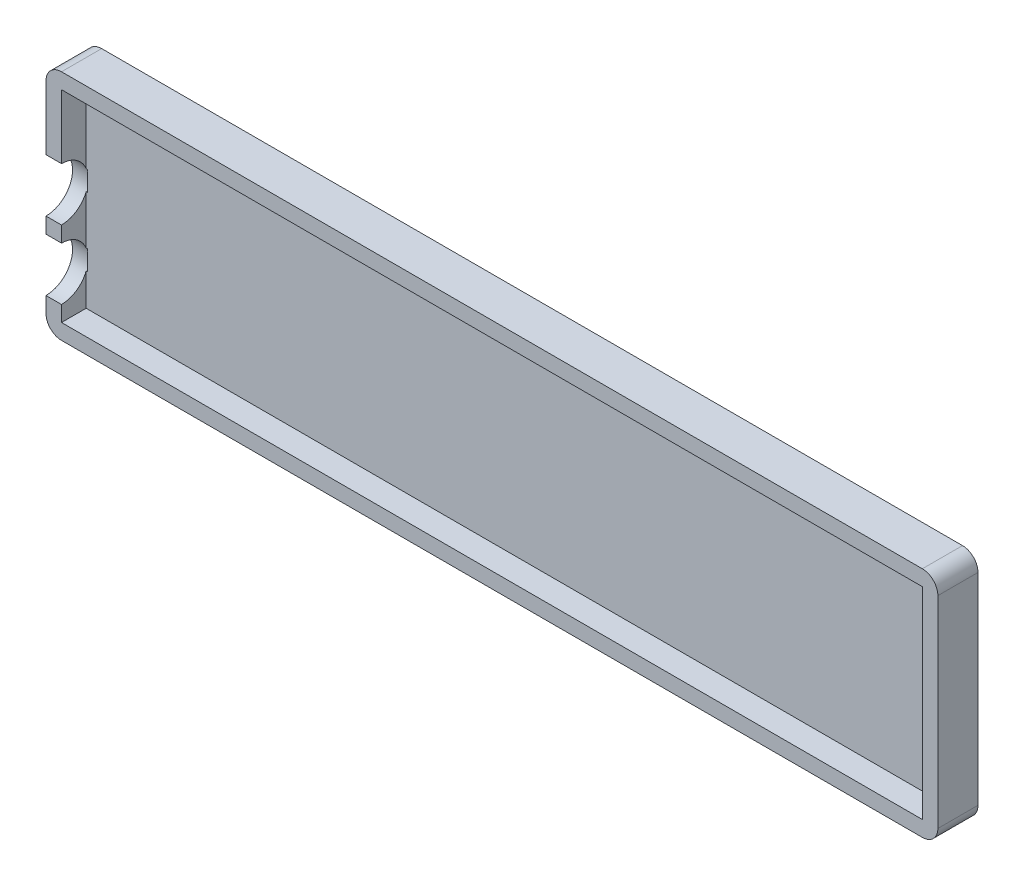
ISO-10303-21;
HEADER;
FILE_DESCRIPTION(('STEP AP214'),'2;1');
FILE_NAME('part.step','',(''),(''),'','','');
FILE_SCHEMA(('AUTOMOTIVE_DESIGN { 1 0 10303 214 1 1 1 1 }'));
ENDSEC;
DATA;
#1=APPLICATION_CONTEXT('core data for automotive mechanical design processes');
#2=APPLICATION_PROTOCOL_DEFINITION('international standard','automotive_design',2000,#1);
#3=PRODUCT_CONTEXT('',#1,'mechanical');
#4=PRODUCT('Part','Part','',(#3));
#5=PRODUCT_RELATED_PRODUCT_CATEGORY('part','',(#4));
#6=PRODUCT_DEFINITION_FORMATION('','',#4);
#7=PRODUCT_DEFINITION_CONTEXT('part definition',#1,'design');
#8=PRODUCT_DEFINITION('design','',#6,#7);
#9=PRODUCT_DEFINITION_SHAPE('','',#8);
#10=(LENGTH_UNIT() NAMED_UNIT(*) SI_UNIT(.MILLI.,.METRE.));
#11=(NAMED_UNIT(*) PLANE_ANGLE_UNIT() SI_UNIT($,.RADIAN.));
#12=(NAMED_UNIT(*) SI_UNIT($,.STERADIAN.) SOLID_ANGLE_UNIT());
#13=UNCERTAINTY_MEASURE_WITH_UNIT(LENGTH_MEASURE(1.E-05),#10,'distance_accuracy_value','');
#14=(GEOMETRIC_REPRESENTATION_CONTEXT(3) GLOBAL_UNCERTAINTY_ASSIGNED_CONTEXT((#13)) GLOBAL_UNIT_ASSIGNED_CONTEXT((#10,
#11,#12)) REPRESENTATION_CONTEXT('',''));
#15=CARTESIAN_POINT('',(0.,0.,0.));
#16=DIRECTION('',(0.,0.,1.));
#17=DIRECTION('',(1.,0.,0.));
#18=AXIS2_PLACEMENT_3D('',#15,#16,#17);
#19=CARTESIAN_POINT('',(-57.5,-15.01,-3.17500000000001));
#20=DIRECTION('',(0.,0.,1.));
#21=DIRECTION('',(1.,0.,0.));
#22=AXIS2_PLACEMENT_3D('',#19,#20,#21);
#23=PLANE('',#22);
#24=CARTESIAN_POINT('',(55.5,13.,-3.17500000000001));
#25=DIRECTION('',(0.,0.,1.));
#26=DIRECTION('',(1.,0.,0.));
#27=AXIS2_PLACEMENT_3D('',#24,#25,#26);
#28=CIRCLE('',#27,2.);
#29=CARTESIAN_POINT('',(55.5,15.,-3.17500000000001));
#30=VERTEX_POINT('',#29);
#31=CARTESIAN_POINT('',(57.5,13.,-3.17500000000001));
#32=VERTEX_POINT('',#31);
#33=EDGE_CURVE('E259',#30,#32,#28,.F.);
#34=ORIENTED_EDGE('',*,*,#33,.F.);
#35=DIRECTION('',(-1.,0.,0.));
#36=VECTOR('',#35,1.);
#37=CARTESIAN_POINT('',(0.,15.,-3.17500000000001));
#38=LINE('',#37,#36);
#39=CARTESIAN_POINT('',(-55.5,15.,-3.17500000000001));
#40=VERTEX_POINT('',#39);
#41=EDGE_CURVE('E284',#30,#40,#38,.T.);
#42=ORIENTED_EDGE('',*,*,#41,.T.);
#43=CARTESIAN_POINT('',(-55.5,13.,-3.17500000000001));
#44=DIRECTION('',(0.,0.,1.));
#45=DIRECTION('',(1.,0.,0.));
#46=AXIS2_PLACEMENT_3D('',#43,#44,#45);
#47=CIRCLE('',#46,2.);
#48=CARTESIAN_POINT('',(-57.5,13.,-3.17500000000001));
#49=VERTEX_POINT('',#48);
#50=EDGE_CURVE('E255',#49,#40,#47,.F.);
#51=ORIENTED_EDGE('',*,*,#50,.F.);
#52=DIRECTION('',(0.,1.,0.));
#53=VECTOR('',#52,1.);
#54=CARTESIAN_POINT('',(-57.5,0.,-3.17500000000001));
#55=LINE('',#54,#53);
#56=CARTESIAN_POINT('',(-57.5,4.73600000000001,-3.17500000000001));
#57=VERTEX_POINT('',#56);
#58=EDGE_CURVE('E266',#57,#49,#55,.T.);
#59=ORIENTED_EDGE('',*,*,#58,.F.);
#60=DIRECTION('',(-1.,0.,0.));
#61=VECTOR('',#60,1.);
#62=CARTESIAN_POINT('',(-55.3,4.73600000000001,-3.17500000000001));
#63=LINE('',#62,#61);
#64=CARTESIAN_POINT('',(-55.5,4.73600000000001,-3.17500000000001));
#65=VERTEX_POINT('',#64);
#66=EDGE_CURVE('E192',#57,#65,#63,.F.);
#67=ORIENTED_EDGE('',*,*,#66,.T.);
#68=DIRECTION('',(0.,1.,0.));
#69=VECTOR('',#68,1.);
#70=CARTESIAN_POINT('',(-55.5,0.,-3.17500000000001));
#71=LINE('',#70,#69);
#72=CARTESIAN_POINT('',(-55.5,13.,-3.17500000000001));
#73=VERTEX_POINT('',#72);
#74=EDGE_CURVE('E187',#65,#73,#71,.T.);
#75=ORIENTED_EDGE('',*,*,#74,.T.);
#76=DIRECTION('',(-1.,0.,0.));
#77=VECTOR('',#76,1.);
#78=CARTESIAN_POINT('',(0.,13.,-3.17500000000001));
#79=LINE('',#78,#77);
#80=CARTESIAN_POINT('',(55.5,13.,-3.17500000000001));
#81=VERTEX_POINT('',#80);
#82=EDGE_CURVE('E273',#81,#73,#79,.T.);
#83=ORIENTED_EDGE('',*,*,#82,.F.);
#84=DIRECTION('',(0.,1.,0.));
#85=VECTOR('',#84,1.);
#86=CARTESIAN_POINT('',(55.5,0.,-3.17500000000001));
#87=LINE('',#86,#85);
#88=CARTESIAN_POINT('',(55.5,-13.,-3.17500000000001));
#89=VERTEX_POINT('',#88);
#90=EDGE_CURVE('E271',#89,#81,#87,.T.);
#91=ORIENTED_EDGE('',*,*,#90,.F.);
#92=DIRECTION('',(-1.,0.,0.));
#93=VECTOR('',#92,1.);
#94=CARTESIAN_POINT('',(0.,-13.,-3.17500000000001));
#95=LINE('',#94,#93);
#96=CARTESIAN_POINT('',(-55.5,-13.,-3.17500000000001));
#97=VERTEX_POINT('',#96);
#98=EDGE_CURVE('E277',#89,#97,#95,.T.);
#99=ORIENTED_EDGE('',*,*,#98,.T.);
#100=CARTESIAN_POINT('',(-55.5,-10.988,-3.17500000000001));
#101=VERTEX_POINT('',#100);
#102=EDGE_CURVE('E186',#97,#101,#71,.T.);
#103=ORIENTED_EDGE('',*,*,#102,.T.);
#104=DIRECTION('',(-1.,0.,0.));
#105=VECTOR('',#104,1.);
#106=CARTESIAN_POINT('',(-55.3,-10.988,-3.17500000000001));
#107=LINE('',#106,#105);
#108=CARTESIAN_POINT('',(-57.5,-10.988,-3.17500000000001));
#109=VERTEX_POINT('',#108);
#110=EDGE_CURVE('E281',#101,#109,#107,.T.);
#111=ORIENTED_EDGE('',*,*,#110,.T.);
#112=CARTESIAN_POINT('',(-57.5,-13.,-3.17500000000001));
#113=VERTEX_POINT('',#112);
#114=EDGE_CURVE('E270',#113,#109,#55,.T.);
#115=ORIENTED_EDGE('',*,*,#114,.F.);
#116=CARTESIAN_POINT('',(-55.5,-13.,-3.17500000000001));
#117=DIRECTION('',(0.,0.,1.));
#118=DIRECTION('',(1.,0.,0.));
#119=AXIS2_PLACEMENT_3D('',#116,#117,#118);
#120=CIRCLE('',#119,2.);
#121=CARTESIAN_POINT('',(-55.5,-15.,-3.17500000000001));
#122=VERTEX_POINT('',#121);
#123=EDGE_CURVE('E257',#122,#113,#120,.F.);
#124=ORIENTED_EDGE('',*,*,#123,.F.);
#125=DIRECTION('',(-1.,0.,0.));
#126=VECTOR('',#125,1.);
#127=CARTESIAN_POINT('',(0.,-15.,-3.17500000000001));
#128=LINE('',#127,#126);
#129=CARTESIAN_POINT('',(55.5,-15.,-3.17500000000001));
#130=VERTEX_POINT('',#129);
#131=EDGE_CURVE('E263',#130,#122,#128,.T.);
#132=ORIENTED_EDGE('',*,*,#131,.F.);
#133=CARTESIAN_POINT('',(55.5,-13.,-3.17500000000001));
#134=DIRECTION('',(0.,0.,1.));
#135=DIRECTION('',(1.,0.,0.));
#136=AXIS2_PLACEMENT_3D('',#133,#134,#135);
#137=CIRCLE('',#136,2.);
#138=CARTESIAN_POINT('',(57.5,-13.,-3.17500000000001));
#139=VERTEX_POINT('',#138);
#140=EDGE_CURVE('E261',#139,#130,#137,.F.);
#141=ORIENTED_EDGE('',*,*,#140,.F.);
#142=DIRECTION('',(0.,1.,0.));
#143=VECTOR('',#142,1.);
#144=CARTESIAN_POINT('',(57.5,0.,-3.17500000000001));
#145=LINE('',#144,#143);
#146=EDGE_CURVE('E195',#139,#32,#145,.T.);
#147=ORIENTED_EDGE('',*,*,#146,.T.);
#148=EDGE_LOOP('',(#34,#42,#51,#59,#67,#75,#83,#91,#99,#103,#111,#115,#124,#132,#141,#147));
#149=FACE_BOUND('',#148,.T.);
#150=ADVANCED_FACE('F35',(#149),#23,.T.);
#151=CARTESIAN_POINT('',(-57.5,-4.138,-3.17500000000001));
#152=VERTEX_POINT('',#151);
#153=CARTESIAN_POINT('',(-57.5,-2.114,-3.17500000000001));
#154=VERTEX_POINT('',#153);
#155=EDGE_CURVE('E269',#152,#154,#55,.T.);
#156=ORIENTED_EDGE('',*,*,#155,.F.);
#157=DIRECTION('',(-1.,0.,0.));
#158=VECTOR('',#157,1.);
#159=CARTESIAN_POINT('',(-55.3,-4.138,-3.17500000000001));
#160=LINE('',#159,#158);
#161=CARTESIAN_POINT('',(-55.5,-4.138,-3.17500000000001));
#162=VERTEX_POINT('',#161);
#163=EDGE_CURVE('E185',#152,#162,#160,.F.);
#164=ORIENTED_EDGE('',*,*,#163,.T.);
#165=CARTESIAN_POINT('',(-55.5,-2.114,-3.17500000000001));
#166=VERTEX_POINT('',#165);
#167=EDGE_CURVE('E174',#162,#166,#71,.T.);
#168=ORIENTED_EDGE('',*,*,#167,.T.);
#169=DIRECTION('',(-1.,0.,0.));
#170=VECTOR('',#169,1.);
#171=CARTESIAN_POINT('',(-55.3,-2.114,-3.17500000000001));
#172=LINE('',#171,#170);
#173=EDGE_CURVE('E183',#166,#154,#172,.T.);
#174=ORIENTED_EDGE('',*,*,#173,.T.);
#175=EDGE_LOOP('',(#156,#164,#168,#174));
#176=FACE_BOUND('',#175,.T.);
#177=ADVANCED_FACE('F182',(#176),#23,.T.);
#178=CARTESIAN_POINT('',(0.,13.,-129.198643240047));
#179=DIRECTION('',(0.,-1.,0.));
#180=DIRECTION('',(0.,0.,-1.));
#181=AXIS2_PLACEMENT_3D('',#178,#179,#180);
#182=PLANE('',#181);
#183=DIRECTION('',(0.,0.,-1.));
#184=VECTOR('',#183,1.);
#185=CARTESIAN_POINT('',(55.5,13.,-129.198643240047));
#186=LINE('',#185,#184);
#187=CARTESIAN_POINT('',(55.5,13.,-6.35));
#188=VERTEX_POINT('',#187);
#189=EDGE_CURVE('E207',#81,#188,#186,.T.);
#190=ORIENTED_EDGE('',*,*,#189,.F.);
#191=ORIENTED_EDGE('',*,*,#82,.T.);
#192=DIRECTION('',(0.,0.,-1.));
#193=VECTOR('',#192,1.);
#194=CARTESIAN_POINT('',(-55.5,13.,-129.198643240047));
#195=LINE('',#194,#193);
#196=CARTESIAN_POINT('',(-55.5,13.,-6.35));
#197=VERTEX_POINT('',#196);
#198=EDGE_CURVE('E204',#73,#197,#195,.T.);
#199=ORIENTED_EDGE('',*,*,#198,.T.);
#200=DIRECTION('',(-1.,0.,0.));
#201=VECTOR('',#200,1.);
#202=CARTESIAN_POINT('',(0.,13.,-6.34999999999999));
#203=LINE('',#202,#201);
#204=EDGE_CURVE('E206',#188,#197,#203,.T.);
#205=ORIENTED_EDGE('',*,*,#204,.F.);
#206=EDGE_LOOP('',(#190,#191,#199,#205));
#207=FACE_BOUND('',#206,.T.);
#208=ADVANCED_FACE('F367',(#207),#182,.T.);
#209=CARTESIAN_POINT('',(-55.5,0.,-129.198643240047));
#210=DIRECTION('',(-1.,0.,0.));
#211=DIRECTION('',(0.,0.,1.));
#212=AXIS2_PLACEMENT_3D('',#209,#210,#211);
#213=PLANE('',#212);
#214=ORIENTED_EDGE('',*,*,#102,.F.);
#215=DIRECTION('',(0.,0.,-1.));
#216=VECTOR('',#215,1.);
#217=CARTESIAN_POINT('',(-55.5,-13.,-129.198643240047));
#218=LINE('',#217,#216);
#219=CARTESIAN_POINT('',(-55.5,-13.,-6.35));
#220=VERTEX_POINT('',#219);
#221=EDGE_CURVE('E201',#97,#220,#218,.T.);
#222=ORIENTED_EDGE('',*,*,#221,.T.);
#223=DIRECTION('',(0.,1.,0.));
#224=VECTOR('',#223,1.);
#225=CARTESIAN_POINT('',(-55.5,0.,-6.34999999999999));
#226=LINE('',#225,#224);
#227=CARTESIAN_POINT('',(-55.5,-8.84752325786654,-6.35));
#228=VERTEX_POINT('',#227);
#229=EDGE_CURVE('E331',#220,#228,#226,.T.);
#230=ORIENTED_EDGE('',*,*,#229,.T.);
#231=CARTESIAN_POINT('',(-55.5,-7.563,-3.175));
#232=DIRECTION('',(-1.,0.,0.));
#233=DIRECTION('',(0.,0.,1.));
#234=AXIS2_PLACEMENT_3D('',#231,#232,#233);
#235=CIRCLE('',#234,3.425);
#236=EDGE_CURVE('E232',#228,#101,#235,.T.);
#237=ORIENTED_EDGE('',*,*,#236,.T.);
#238=EDGE_LOOP('',(#214,#222,#230,#237));
#239=FACE_BOUND('',#238,.T.);
#240=ADVANCED_FACE('F369',(#239),#213,.F.);
#241=ORIENTED_EDGE('',*,*,#167,.F.);
#242=CARTESIAN_POINT('',(-55.5,-6.27847674213346,-6.34999999999999));
#243=VERTEX_POINT('',#242);
#244=EDGE_CURVE('E234',#162,#243,#235,.T.);
#245=ORIENTED_EDGE('',*,*,#244,.T.);
#246=CARTESIAN_POINT('',(-55.5,0.0264767421334685,-6.35));
#247=VERTEX_POINT('',#246);
#248=EDGE_CURVE('E177',#243,#247,#226,.T.);
#249=ORIENTED_EDGE('',*,*,#248,.T.);
#250=CARTESIAN_POINT('',(-55.5,1.311,-3.17500000000001));
#251=DIRECTION('',(-1.,0.,0.));
#252=DIRECTION('',(0.,0.,1.));
#253=AXIS2_PLACEMENT_3D('',#250,#251,#252);
#254=CIRCLE('',#253,3.425);
#255=EDGE_CURVE('E57',#247,#166,#254,.T.);
#256=ORIENTED_EDGE('',*,*,#255,.T.);
#257=EDGE_LOOP('',(#241,#245,#249,#256));
#258=FACE_BOUND('',#257,.T.);
#259=ADVANCED_FACE('F173',(#258),#213,.F.);
#260=ORIENTED_EDGE('',*,*,#74,.F.);
#261=CARTESIAN_POINT('',(-55.5,2.59552325786655,-6.34999999999999));
#262=VERTEX_POINT('',#261);
#263=EDGE_CURVE('E178',#65,#262,#254,.T.);
#264=ORIENTED_EDGE('',*,*,#263,.T.);
#265=EDGE_CURVE('E335',#262,#197,#226,.T.);
#266=ORIENTED_EDGE('',*,*,#265,.T.);
#267=ORIENTED_EDGE('',*,*,#198,.F.);
#268=EDGE_LOOP('',(#260,#264,#266,#267));
#269=FACE_BOUND('',#268,.T.);
#270=ADVANCED_FACE('F378',(#269),#213,.F.);
#271=CARTESIAN_POINT('',(0.,-13.,-129.198643240047));
#272=DIRECTION('',(0.,-1.,0.));
#273=DIRECTION('',(0.,0.,-1.));
#274=AXIS2_PLACEMENT_3D('',#271,#272,#273);
#275=PLANE('',#274);
#276=ORIENTED_EDGE('',*,*,#98,.F.);
#277=DIRECTION('',(0.,0.,-1.));
#278=VECTOR('',#277,1.);
#279=CARTESIAN_POINT('',(55.5,-13.,-129.198643240047));
#280=LINE('',#279,#278);
#281=CARTESIAN_POINT('',(55.5,-13.,-6.34999999999999));
#282=VERTEX_POINT('',#281);
#283=EDGE_CURVE('E199',#89,#282,#280,.T.);
#284=ORIENTED_EDGE('',*,*,#283,.T.);
#285=DIRECTION('',(-1.,0.,0.));
#286=VECTOR('',#285,1.);
#287=CARTESIAN_POINT('',(0.,-13.,-6.34999999999999));
#288=LINE('',#287,#286);
#289=EDGE_CURVE('E336',#282,#220,#288,.T.);
#290=ORIENTED_EDGE('',*,*,#289,.T.);
#291=ORIENTED_EDGE('',*,*,#221,.F.);
#292=EDGE_LOOP('',(#276,#284,#290,#291));
#293=FACE_BOUND('',#292,.T.);
#294=ADVANCED_FACE('F383',(#293),#275,.F.);
#295=CARTESIAN_POINT('',(55.5,0.,-129.198643240047));
#296=DIRECTION('',(-1.,0.,0.));
#297=DIRECTION('',(0.,0.,1.));
#298=AXIS2_PLACEMENT_3D('',#295,#296,#297);
#299=PLANE('',#298);
#300=ORIENTED_EDGE('',*,*,#283,.F.);
#301=ORIENTED_EDGE('',*,*,#90,.T.);
#302=ORIENTED_EDGE('',*,*,#189,.T.);
#303=DIRECTION('',(0.,1.,0.));
#304=VECTOR('',#303,1.);
#305=CARTESIAN_POINT('',(55.5,0.,-6.34999999999999));
#306=LINE('',#305,#304);
#307=EDGE_CURVE('E202',#282,#188,#306,.T.);
#308=ORIENTED_EDGE('',*,*,#307,.F.);
#309=EDGE_LOOP('',(#300,#301,#302,#308));
#310=FACE_BOUND('',#309,.T.);
#311=ADVANCED_FACE('F37',(#310),#299,.T.);
#312=CARTESIAN_POINT('',(-55.3,-7.563,-3.175));
#313=DIRECTION('',(-1.,0.,0.));
#314=DIRECTION('',(0.,0.,1.));
#315=AXIS2_PLACEMENT_3D('',#312,#313,#314);
#316=CYLINDRICAL_SURFACE('',#315,3.425);
#317=ORIENTED_EDGE('',*,*,#163,.F.);
#318=CARTESIAN_POINT('',(-57.5,-7.563,-3.175));
#319=DIRECTION('',(-1.,0.,0.));
#320=DIRECTION('',(0.,0.,1.));
#321=AXIS2_PLACEMENT_3D('',#318,#319,#320);
#322=CIRCLE('',#321,3.425);
#323=EDGE_CURVE('E236',#152,#109,#322,.T.);
#324=ORIENTED_EDGE('',*,*,#323,.T.);
#325=ORIENTED_EDGE('',*,*,#110,.F.);
#326=ORIENTED_EDGE('',*,*,#236,.F.);
#327=DIRECTION('',(-1.,0.,0.));
#328=VECTOR('',#327,1.);
#329=CARTESIAN_POINT('',(-55.3,-8.84752325786654,-6.35));
#330=LINE('',#329,#328);
#331=CARTESIAN_POINT('',(-55.3,-8.84752325786653,-6.35));
#332=VERTEX_POINT('',#331);
#333=EDGE_CURVE('E345',#228,#332,#330,.F.);
#334=ORIENTED_EDGE('',*,*,#333,.T.);
#335=CARTESIAN_POINT('',(-55.3,-7.563,-3.175));
#336=DIRECTION('',(-1.,0.,0.));
#337=DIRECTION('',(0.,0.,1.));
#338=AXIS2_PLACEMENT_3D('',#335,#336,#337);
#339=CIRCLE('',#338,3.425);
#340=CARTESIAN_POINT('',(-55.3,-6.27847674213347,-6.35));
#341=VERTEX_POINT('',#340);
#342=EDGE_CURVE('E238',#341,#332,#339,.T.);
#343=ORIENTED_EDGE('',*,*,#342,.F.);
#344=DIRECTION('',(-1.,0.,0.));
#345=VECTOR('',#344,1.);
#346=CARTESIAN_POINT('',(-55.3,-6.27847674213347,-6.35));
#347=LINE('',#346,#345);
#348=EDGE_CURVE('E347',#341,#243,#347,.T.);
#349=ORIENTED_EDGE('',*,*,#348,.T.);
#350=ORIENTED_EDGE('',*,*,#244,.F.);
#351=EDGE_LOOP('',(#317,#324,#325,#326,#334,#343,#349,#350));
#352=FACE_BOUND('',#351,.T.);
#353=ADVANCED_FACE('F390',(#352),#316,.F.);
#354=CARTESIAN_POINT('',(0.,15.,-129.198643240047));
#355=DIRECTION('',(0.,-1.,0.));
#356=DIRECTION('',(0.,0.,-1.));
#357=AXIS2_PLACEMENT_3D('',#354,#355,#356);
#358=PLANE('',#357);
#359=ORIENTED_EDGE('',*,*,#41,.F.);
#360=DIRECTION('',(0.,0.,1.));
#361=VECTOR('',#360,1.);
#362=CARTESIAN_POINT('',(55.5,15.,-129.198643240047));
#363=LINE('',#362,#361);
#364=CARTESIAN_POINT('',(55.5,15.,-8.34999999999999));
#365=VERTEX_POINT('',#364);
#366=EDGE_CURVE('E214',#30,#365,#363,.F.);
#367=ORIENTED_EDGE('',*,*,#366,.T.);
#368=DIRECTION('',(-1.,0.,0.));
#369=VECTOR('',#368,1.);
#370=CARTESIAN_POINT('',(0.,15.,-8.35));
#371=LINE('',#370,#369);
#372=CARTESIAN_POINT('',(-55.5,15.,-8.35));
#373=VERTEX_POINT('',#372);
#374=EDGE_CURVE('E235',#365,#373,#371,.T.);
#375=ORIENTED_EDGE('',*,*,#374,.T.);
#376=DIRECTION('',(0.,0.,1.));
#377=VECTOR('',#376,1.);
#378=CARTESIAN_POINT('',(-55.5,15.,5.50000000000001));
#379=LINE('',#378,#377);
#380=EDGE_CURVE('E216',#373,#40,#379,.T.);
#381=ORIENTED_EDGE('',*,*,#380,.T.);
#382=EDGE_LOOP('',(#359,#367,#375,#381));
#383=FACE_BOUND('',#382,.T.);
#384=ADVANCED_FACE('F305',(#383),#358,.F.);
#385=CARTESIAN_POINT('',(-57.5,0.,-129.198643240047));
#386=DIRECTION('',(-1.,0.,0.));
#387=DIRECTION('',(0.,0.,1.));
#388=AXIS2_PLACEMENT_3D('',#385,#386,#387);
#389=PLANE('',#388);
#390=DIRECTION('',(0.,0.,1.));
#391=VECTOR('',#390,1.);
#392=CARTESIAN_POINT('',(-57.5,-13.,-129.198643240047));
#393=LINE('',#392,#391);
#394=CARTESIAN_POINT('',(-57.5,-13.,-8.34999999999999));
#395=VERTEX_POINT('',#394);
#396=EDGE_CURVE('E209',#395,#113,#393,.T.);
#397=ORIENTED_EDGE('',*,*,#396,.T.);
#398=ORIENTED_EDGE('',*,*,#114,.T.);
#399=ORIENTED_EDGE('',*,*,#323,.F.);
#400=ORIENTED_EDGE('',*,*,#155,.T.);
#401=CARTESIAN_POINT('',(-57.5,1.311,-3.17500000000001));
#402=DIRECTION('',(-1.,0.,0.));
#403=DIRECTION('',(0.,0.,1.));
#404=AXIS2_PLACEMENT_3D('',#401,#402,#403);
#405=CIRCLE('',#404,3.425);
#406=EDGE_CURVE('E11',#57,#154,#405,.T.);
#407=ORIENTED_EDGE('',*,*,#406,.F.);
#408=ORIENTED_EDGE('',*,*,#58,.T.);
#409=DIRECTION('',(0.,0.,1.));
#410=VECTOR('',#409,1.);
#411=CARTESIAN_POINT('',(-57.5,13.,-8.35));
#412=LINE('',#411,#410);
#413=CARTESIAN_POINT('',(-57.5,13.,-8.35));
#414=VERTEX_POINT('',#413);
#415=EDGE_CURVE('E212',#49,#414,#412,.F.);
#416=ORIENTED_EDGE('',*,*,#415,.T.);
#417=DIRECTION('',(0.,1.,0.));
#418=VECTOR('',#417,1.);
#419=CARTESIAN_POINT('',(-57.5,0.,-8.35));
#420=LINE('',#419,#418);
#421=EDGE_CURVE('E249',#395,#414,#420,.T.);
#422=ORIENTED_EDGE('',*,*,#421,.F.);
#423=EDGE_LOOP('',(#397,#398,#399,#400,#407,#408,#416,#422));
#424=FACE_BOUND('',#423,.T.);
#425=ADVANCED_FACE('F405',(#424),#389,.T.);
#426=CARTESIAN_POINT('',(0.,-15.,-129.198643240047));
#427=DIRECTION('',(0.,-1.,0.));
#428=DIRECTION('',(0.,0.,-1.));
#429=AXIS2_PLACEMENT_3D('',#426,#427,#428);
#430=PLANE('',#429);
#431=DIRECTION('',(0.,0.,1.));
#432=VECTOR('',#431,1.);
#433=CARTESIAN_POINT('',(55.5,-15.,5.50000000000001));
#434=LINE('',#433,#432);
#435=CARTESIAN_POINT('',(55.5,-15.,-8.34999999999999));
#436=VERTEX_POINT('',#435);
#437=EDGE_CURVE('E226',#436,#130,#434,.T.);
#438=ORIENTED_EDGE('',*,*,#437,.T.);
#439=ORIENTED_EDGE('',*,*,#131,.T.);
#440=DIRECTION('',(0.,0.,1.));
#441=VECTOR('',#440,1.);
#442=CARTESIAN_POINT('',(-55.5,-15.,-129.198643240047));
#443=LINE('',#442,#441);
#444=CARTESIAN_POINT('',(-55.5,-15.,-8.35));
#445=VERTEX_POINT('',#444);
#446=EDGE_CURVE('E229',#122,#445,#443,.F.);
#447=ORIENTED_EDGE('',*,*,#446,.T.);
#448=DIRECTION('',(-1.,0.,0.));
#449=VECTOR('',#448,1.);
#450=CARTESIAN_POINT('',(0.,-15.,-8.35));
#451=LINE('',#450,#449);
#452=EDGE_CURVE('E312',#436,#445,#451,.T.);
#453=ORIENTED_EDGE('',*,*,#452,.F.);
#454=EDGE_LOOP('',(#438,#439,#447,#453));
#455=FACE_BOUND('',#454,.T.);
#456=ADVANCED_FACE('F418',(#455),#430,.T.);
#457=CARTESIAN_POINT('',(57.5,0.,-129.198643240047));
#458=DIRECTION('',(-1.,0.,0.));
#459=DIRECTION('',(0.,0.,1.));
#460=AXIS2_PLACEMENT_3D('',#457,#458,#459);
#461=PLANE('',#460);
#462=ORIENTED_EDGE('',*,*,#146,.F.);
#463=DIRECTION('',(0.,0.,1.));
#464=VECTOR('',#463,1.);
#465=CARTESIAN_POINT('',(57.5,-13.,-8.35));
#466=LINE('',#465,#464);
#467=CARTESIAN_POINT('',(57.5,-13.,-8.34999999999999));
#468=VERTEX_POINT('',#467);
#469=EDGE_CURVE('E220',#139,#468,#466,.F.);
#470=ORIENTED_EDGE('',*,*,#469,.T.);
#471=DIRECTION('',(0.,1.,0.));
#472=VECTOR('',#471,1.);
#473=CARTESIAN_POINT('',(57.5,0.,-8.35));
#474=LINE('',#473,#472);
#475=CARTESIAN_POINT('',(57.5,13.,-8.35));
#476=VERTEX_POINT('',#475);
#477=EDGE_CURVE('E231',#468,#476,#474,.T.);
#478=ORIENTED_EDGE('',*,*,#477,.T.);
#479=DIRECTION('',(0.,0.,1.));
#480=VECTOR('',#479,1.);
#481=CARTESIAN_POINT('',(57.5,13.,-129.198643240047));
#482=LINE('',#481,#480);
#483=EDGE_CURVE('E222',#476,#32,#482,.T.);
#484=ORIENTED_EDGE('',*,*,#483,.T.);
#485=EDGE_LOOP('',(#462,#470,#478,#484));
#486=FACE_BOUND('',#485,.T.);
#487=ADVANCED_FACE('F295',(#486),#461,.F.);
#488=CARTESIAN_POINT('',(55.5,-13.,-129.198643240047));
#489=DIRECTION('',(0.,0.,-1.));
#490=DIRECTION('',(-1.,0.,0.));
#491=AXIS2_PLACEMENT_3D('',#488,#489,#490);
#492=CYLINDRICAL_SURFACE('',#491,2.);
#493=ORIENTED_EDGE('',*,*,#469,.F.);
#494=ORIENTED_EDGE('',*,*,#140,.T.);
#495=ORIENTED_EDGE('',*,*,#437,.F.);
#496=CARTESIAN_POINT('',(55.5,-13.,-8.35));
#497=DIRECTION('',(0.,0.,1.));
#498=DIRECTION('',(0.,-1.,0.));
#499=AXIS2_PLACEMENT_3D('',#496,#497,#498);
#500=CIRCLE('',#499,2.);
#501=EDGE_CURVE('E219',#468,#436,#500,.F.);
#502=ORIENTED_EDGE('',*,*,#501,.F.);
#503=EDGE_LOOP('',(#493,#494,#495,#502));
#504=FACE_BOUND('',#503,.T.);
#505=ADVANCED_FACE('F381',(#504),#492,.T.);
#506=CARTESIAN_POINT('',(55.5,13.,-129.198643240047));
#507=DIRECTION('',(0.,0.,1.));
#508=DIRECTION('',(1.,0.,0.));
#509=AXIS2_PLACEMENT_3D('',#506,#507,#508);
#510=CYLINDRICAL_SURFACE('',#509,2.);
#511=ORIENTED_EDGE('',*,*,#366,.F.);
#512=ORIENTED_EDGE('',*,*,#33,.T.);
#513=ORIENTED_EDGE('',*,*,#483,.F.);
#514=CARTESIAN_POINT('',(55.5,13.,-8.35));
#515=DIRECTION('',(0.,0.,1.));
#516=DIRECTION('',(0.,-1.,0.));
#517=AXIS2_PLACEMENT_3D('',#514,#515,#516);
#518=CIRCLE('',#517,2.);
#519=EDGE_CURVE('E301',#365,#476,#518,.F.);
#520=ORIENTED_EDGE('',*,*,#519,.F.);
#521=EDGE_LOOP('',(#511,#512,#513,#520));
#522=FACE_BOUND('',#521,.T.);
#523=ADVANCED_FACE('F300',(#522),#510,.T.);
#524=CARTESIAN_POINT('',(-55.5,-13.,-129.198643240047));
#525=DIRECTION('',(0.,0.,1.));
#526=DIRECTION('',(1.,0.,0.));
#527=AXIS2_PLACEMENT_3D('',#524,#525,#526);
#528=CYLINDRICAL_SURFACE('',#527,2.);
#529=ORIENTED_EDGE('',*,*,#446,.F.);
#530=ORIENTED_EDGE('',*,*,#123,.T.);
#531=ORIENTED_EDGE('',*,*,#396,.F.);
#532=CARTESIAN_POINT('',(-55.5,-13.,-8.35));
#533=DIRECTION('',(0.,0.,1.));
#534=DIRECTION('',(0.,-1.,0.));
#535=AXIS2_PLACEMENT_3D('',#532,#533,#534);
#536=CIRCLE('',#535,2.);
#537=EDGE_CURVE('E319',#445,#395,#536,.F.);
#538=ORIENTED_EDGE('',*,*,#537,.F.);
#539=EDGE_LOOP('',(#529,#530,#531,#538));
#540=FACE_BOUND('',#539,.T.);
#541=ADVANCED_FACE('F327',(#540),#528,.T.);
#542=CARTESIAN_POINT('',(-55.5,13.,-129.198643240047));
#543=DIRECTION('',(0.,0.,-1.));
#544=DIRECTION('',(-1.,0.,0.));
#545=AXIS2_PLACEMENT_3D('',#542,#543,#544);
#546=CYLINDRICAL_SURFACE('',#545,2.);
#547=ORIENTED_EDGE('',*,*,#415,.F.);
#548=ORIENTED_EDGE('',*,*,#50,.T.);
#549=ORIENTED_EDGE('',*,*,#380,.F.);
#550=CARTESIAN_POINT('',(-55.5,13.,-8.35));
#551=DIRECTION('',(0.,0.,1.));
#552=DIRECTION('',(0.,-1.,0.));
#553=AXIS2_PLACEMENT_3D('',#550,#551,#552);
#554=CIRCLE('',#553,2.);
#555=EDGE_CURVE('E223',#414,#373,#554,.F.);
#556=ORIENTED_EDGE('',*,*,#555,.F.);
#557=EDGE_LOOP('',(#547,#548,#549,#556));
#558=FACE_BOUND('',#557,.T.);
#559=ADVANCED_FACE('F407',(#558),#546,.T.);
#560=CARTESIAN_POINT('',(-55.3,1.311,-3.17500000000001));
#561=DIRECTION('',(-1.,0.,0.));
#562=DIRECTION('',(0.,0.,1.));
#563=AXIS2_PLACEMENT_3D('',#560,#561,#562);
#564=CYLINDRICAL_SURFACE('',#563,3.425);
#565=ORIENTED_EDGE('',*,*,#66,.F.);
#566=ORIENTED_EDGE('',*,*,#406,.T.);
#567=ORIENTED_EDGE('',*,*,#173,.F.);
#568=ORIENTED_EDGE('',*,*,#255,.F.);
#569=DIRECTION('',(-1.,0.,0.));
#570=VECTOR('',#569,1.);
#571=CARTESIAN_POINT('',(-55.3,0.0264767421334685,-6.35));
#572=LINE('',#571,#570);
#573=CARTESIAN_POINT('',(-55.3,0.0264767421334672,-6.35));
#574=VERTEX_POINT('',#573);
#575=EDGE_CURVE('E252',#247,#574,#572,.F.);
#576=ORIENTED_EDGE('',*,*,#575,.T.);
#577=CARTESIAN_POINT('',(-55.3,1.311,-3.17500000000001));
#578=DIRECTION('',(-1.,0.,0.));
#579=DIRECTION('',(0.,0.,1.));
#580=AXIS2_PLACEMENT_3D('',#577,#578,#579);
#581=CIRCLE('',#580,3.425);
#582=CARTESIAN_POINT('',(-55.3,2.59552325786654,-6.35));
#583=VERTEX_POINT('',#582);
#584=EDGE_CURVE('E43',#583,#574,#581,.T.);
#585=ORIENTED_EDGE('',*,*,#584,.F.);
#586=DIRECTION('',(-1.,0.,0.));
#587=VECTOR('',#586,1.);
#588=CARTESIAN_POINT('',(-55.3,2.59552325786654,-6.35));
#589=LINE('',#588,#587);
#590=EDGE_CURVE('E179',#583,#262,#589,.T.);
#591=ORIENTED_EDGE('',*,*,#590,.T.);
#592=ORIENTED_EDGE('',*,*,#263,.F.);
#593=EDGE_LOOP('',(#565,#566,#567,#568,#576,#585,#591,#592));
#594=FACE_BOUND('',#593,.T.);
#595=ADVANCED_FACE('F190',(#594),#564,.F.);
#596=CARTESIAN_POINT('',(-37.95,-2.626,-6.35));
#597=DIRECTION('',(0.,0.,1.));
#598=DIRECTION('',(0.,1.,0.));
#599=AXIS2_PLACEMENT_3D('',#596,#597,#598);
#600=PLANE('',#599);
#601=ORIENTED_EDGE('',*,*,#590,.F.);
#602=DIRECTION('',(0.,-1.,0.));
#603=VECTOR('',#602,1.);
#604=CARTESIAN_POINT('',(-55.3,-2.626,-6.35));
#605=LINE('',#604,#603);
#606=EDGE_CURVE('E49',#583,#574,#605,.T.);
#607=ORIENTED_EDGE('',*,*,#606,.T.);
#608=ORIENTED_EDGE('',*,*,#575,.F.);
#609=ORIENTED_EDGE('',*,*,#248,.F.);
#610=ORIENTED_EDGE('',*,*,#348,.F.);
#611=DIRECTION('',(0.,-1.,0.));
#612=VECTOR('',#611,1.);
#613=CARTESIAN_POINT('',(-55.3,-2.626,-6.35));
#614=LINE('',#613,#612);
#615=EDGE_CURVE('E334',#341,#332,#614,.T.);
#616=ORIENTED_EDGE('',*,*,#615,.T.);
#617=ORIENTED_EDGE('',*,*,#333,.F.);
#618=ORIENTED_EDGE('',*,*,#229,.F.);
#619=ORIENTED_EDGE('',*,*,#289,.F.);
#620=ORIENTED_EDGE('',*,*,#307,.T.);
#621=ORIENTED_EDGE('',*,*,#204,.T.);
#622=ORIENTED_EDGE('',*,*,#265,.F.);
#623=EDGE_LOOP('',(#601,#607,#608,#609,#610,#616,#617,#618,#619,#620,#621,#622));
#624=FACE_BOUND('',#623,.T.);
#625=ADVANCED_FACE('F352',(#624),#600,.T.);
#626=CARTESIAN_POINT('',(-55.3,0.,0.));
#627=DIRECTION('',(-1.,0.,0.));
#628=DIRECTION('',(0.,0.,1.));
#629=AXIS2_PLACEMENT_3D('',#626,#627,#628);
#630=PLANE('',#629);
#631=ORIENTED_EDGE('',*,*,#342,.T.);
#632=ORIENTED_EDGE('',*,*,#615,.F.);
#633=EDGE_LOOP('',(#631,#632));
#634=FACE_BOUND('',#633,.T.);
#635=ADVANCED_FACE('F362',(#634),#630,.T.);
#636=CARTESIAN_POINT('',(-37.95,-2.626,-8.35));
#637=DIRECTION('',(0.,0.,1.));
#638=DIRECTION('',(0.,1.,0.));
#639=AXIS2_PLACEMENT_3D('',#636,#637,#638);
#640=PLANE('',#639);
#641=ORIENTED_EDGE('',*,*,#477,.F.);
#642=ORIENTED_EDGE('',*,*,#501,.T.);
#643=ORIENTED_EDGE('',*,*,#452,.T.);
#644=ORIENTED_EDGE('',*,*,#537,.T.);
#645=ORIENTED_EDGE('',*,*,#421,.T.);
#646=ORIENTED_EDGE('',*,*,#555,.T.);
#647=ORIENTED_EDGE('',*,*,#374,.F.);
#648=ORIENTED_EDGE('',*,*,#519,.T.);
#649=EDGE_LOOP('',(#641,#642,#643,#644,#645,#646,#647,#648));
#650=FACE_BOUND('',#649,.T.);
#651=ADVANCED_FACE('F308',(#650),#640,.F.);
#652=CARTESIAN_POINT('',(-55.3,0.,0.));
#653=DIRECTION('',(-1.,0.,0.));
#654=DIRECTION('',(0.,0.,1.));
#655=AXIS2_PLACEMENT_3D('',#652,#653,#654);
#656=PLANE('',#655);
#657=ORIENTED_EDGE('',*,*,#584,.T.);
#658=ORIENTED_EDGE('',*,*,#606,.F.);
#659=EDGE_LOOP('',(#657,#658));
#660=FACE_BOUND('',#659,.T.);
#661=ADVANCED_FACE('F356',(#660),#656,.T.);
#662=CLOSED_SHELL('',(#150,#177,#208,#240,#259,#270,#294,#311,#353,#384,#425,#456,#487,#505,
#523,#541,#559,#595,#625,#635,#651,#661));
#663=MANIFOLD_SOLID_BREP('B2',#662);
#664=ADVANCED_BREP_SHAPE_REPRESENTATION('',(#18,#663),#14);
#665=SHAPE_DEFINITION_REPRESENTATION(#9,#664);
ENDSEC;
END-ISO-10303-21;
